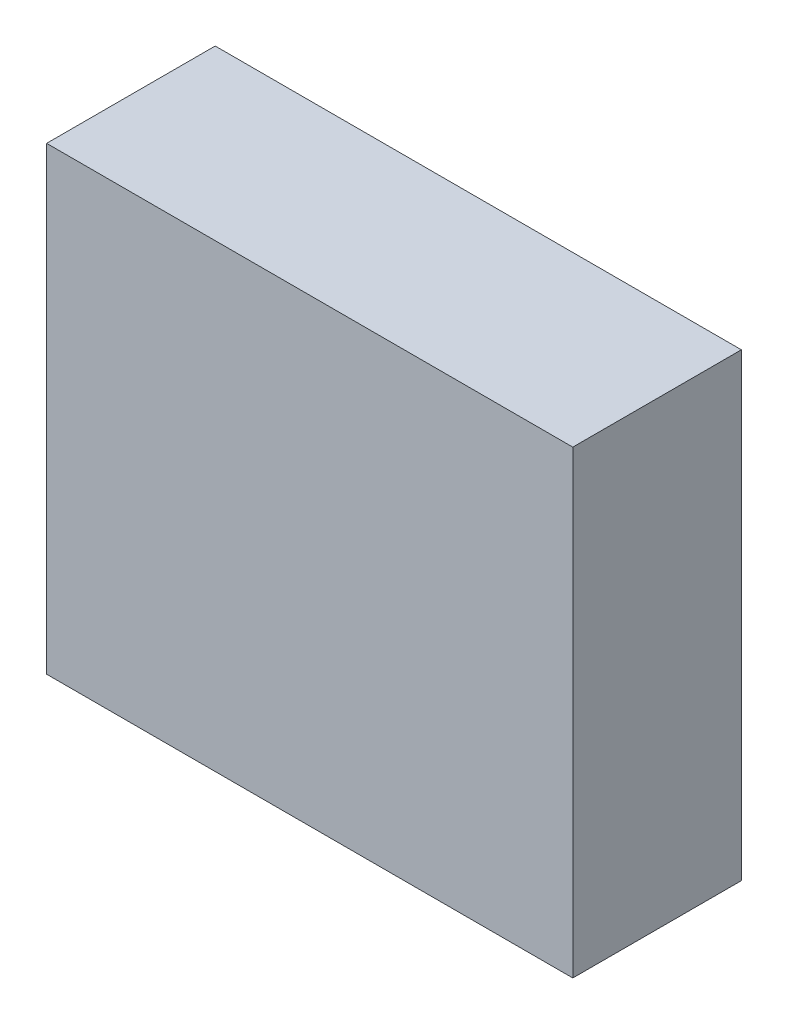
ISO-10303-21;
HEADER;
FILE_DESCRIPTION(('STEP AP214'),'2;1');
FILE_NAME('part.step','',(''),(''),'','','');
FILE_SCHEMA(('AUTOMOTIVE_DESIGN { 1 0 10303 214 1 1 1 1 }'));
ENDSEC;
DATA;
#1=APPLICATION_CONTEXT('core data for automotive mechanical design processes');
#2=APPLICATION_PROTOCOL_DEFINITION('international standard','automotive_design',2000,#1);
#3=PRODUCT_CONTEXT('',#1,'mechanical');
#4=PRODUCT('Part','Part','',(#3));
#5=PRODUCT_RELATED_PRODUCT_CATEGORY('part','',(#4));
#6=PRODUCT_DEFINITION_FORMATION('','',#4);
#7=PRODUCT_DEFINITION_CONTEXT('part definition',#1,'design');
#8=PRODUCT_DEFINITION('design','',#6,#7);
#9=PRODUCT_DEFINITION_SHAPE('','',#8);
#10=(LENGTH_UNIT() NAMED_UNIT(*) SI_UNIT(.MILLI.,.METRE.));
#11=(NAMED_UNIT(*) PLANE_ANGLE_UNIT() SI_UNIT($,.RADIAN.));
#12=(NAMED_UNIT(*) SI_UNIT($,.STERADIAN.) SOLID_ANGLE_UNIT());
#13=UNCERTAINTY_MEASURE_WITH_UNIT(LENGTH_MEASURE(1.E-05),#10,'distance_accuracy_value','');
#14=(GEOMETRIC_REPRESENTATION_CONTEXT(3) GLOBAL_UNCERTAINTY_ASSIGNED_CONTEXT((#13)) GLOBAL_UNIT_ASSIGNED_CONTEXT((#10,
#11,#12)) REPRESENTATION_CONTEXT('',''));
#15=CARTESIAN_POINT('',(0.,0.,0.));
#16=DIRECTION('',(0.,0.,1.));
#17=DIRECTION('',(1.,0.,0.));
#18=AXIS2_PLACEMENT_3D('',#15,#16,#17);
#19=CARTESIAN_POINT('',(-11.2498269896194,-9.34793211402207,3.3));
#20=DIRECTION('',(0.,1.,0.));
#21=DIRECTION('',(0.,0.,1.));
#22=AXIS2_PLACEMENT_3D('',#19,#20,#21);
#23=PLANE('',#22);
#24=DIRECTION('',(1.,0.,0.));
#25=VECTOR('',#24,1.);
#26=CARTESIAN_POINT('',(-11.2498269896194,-9.34793211402207,0.));
#27=LINE('',#26,#25);
#28=CARTESIAN_POINT('',(-11.2498269896194,-9.34793211402207,0.));
#29=VERTEX_POINT('',#28);
#30=CARTESIAN_POINT('',(-0.949826989619349,-9.34793211402207,0.));
#31=VERTEX_POINT('',#30);
#32=EDGE_CURVE('E114',#29,#31,#27,.T.);
#33=ORIENTED_EDGE('',*,*,#32,.F.);
#34=DIRECTION('',(0.,0.,-1.));
#35=VECTOR('',#34,1.);
#36=CARTESIAN_POINT('',(-11.2498269896194,-9.34793211402207,3.3));
#37=LINE('',#36,#35);
#38=CARTESIAN_POINT('',(-11.2498269896194,-9.34793211402207,3.3));
#39=VERTEX_POINT('',#38);
#40=EDGE_CURVE('E11',#39,#29,#37,.T.);
#41=ORIENTED_EDGE('',*,*,#40,.F.);
#42=DIRECTION('',(1.,0.,0.));
#43=VECTOR('',#42,1.);
#44=CARTESIAN_POINT('',(-11.2498269896194,-9.34793211402207,3.3));
#45=LINE('',#44,#43);
#46=CARTESIAN_POINT('',(-0.949826989619349,-9.34793211402207,3.3));
#47=VERTEX_POINT('',#46);
#48=EDGE_CURVE('E107',#39,#47,#45,.T.);
#49=ORIENTED_EDGE('',*,*,#48,.T.);
#50=DIRECTION('',(0.,0.,-1.));
#51=VECTOR('',#50,1.);
#52=CARTESIAN_POINT('',(-0.949826989619349,-9.34793211402207,3.3));
#53=LINE('',#52,#51);
#54=EDGE_CURVE('E46',#47,#31,#53,.T.);
#55=ORIENTED_EDGE('',*,*,#54,.T.);
#56=EDGE_LOOP('',(#33,#41,#49,#55));
#57=FACE_BOUND('',#56,.T.);
#58=ADVANCED_FACE('F43',(#57),#23,.T.);
#59=CARTESIAN_POINT('',(-11.2498269896194,-9.34793211402207,3.3));
#60=DIRECTION('',(1.,0.,0.));
#61=DIRECTION('',(0.,1.,0.));
#62=AXIS2_PLACEMENT_3D('',#59,#60,#61);
#63=PLANE('',#62);
#64=DIRECTION('',(0.,-1.,0.));
#65=VECTOR('',#64,1.);
#66=CARTESIAN_POINT('',(-11.2498269896194,-9.34793211402207,0.));
#67=LINE('',#66,#65);
#68=CARTESIAN_POINT('',(-11.2498269896193,-18.3479321140221,0.));
#69=VERTEX_POINT('',#68);
#70=EDGE_CURVE('E77',#29,#69,#67,.T.);
#71=ORIENTED_EDGE('',*,*,#70,.T.);
#72=DIRECTION('',(0.,0.,-1.));
#73=VECTOR('',#72,1.);
#74=CARTESIAN_POINT('',(-11.2498269896193,-18.3479321140221,3.3));
#75=LINE('',#74,#73);
#76=CARTESIAN_POINT('',(-11.2498269896193,-18.3479321140221,3.3));
#77=VERTEX_POINT('',#76);
#78=EDGE_CURVE('E53',#77,#69,#75,.T.);
#79=ORIENTED_EDGE('',*,*,#78,.F.);
#80=DIRECTION('',(0.,-1.,0.));
#81=VECTOR('',#80,1.);
#82=CARTESIAN_POINT('',(-11.2498269896194,-9.34793211402207,3.3));
#83=LINE('',#82,#81);
#84=EDGE_CURVE('E94',#39,#77,#83,.T.);
#85=ORIENTED_EDGE('',*,*,#84,.F.);
#86=ORIENTED_EDGE('',*,*,#40,.T.);
#87=EDGE_LOOP('',(#71,#79,#85,#86));
#88=FACE_BOUND('',#87,.T.);
#89=ADVANCED_FACE('F130',(#88),#63,.F.);
#90=CARTESIAN_POINT('',(-11.2498269896193,-18.3479321140221,3.3));
#91=DIRECTION('',(0.,1.,0.));
#92=DIRECTION('',(0.,0.,1.));
#93=AXIS2_PLACEMENT_3D('',#90,#91,#92);
#94=PLANE('',#93);
#95=DIRECTION('',(1.,0.,0.));
#96=VECTOR('',#95,1.);
#97=CARTESIAN_POINT('',(-11.2498269896193,-18.3479321140221,0.));
#98=LINE('',#97,#96);
#99=CARTESIAN_POINT('',(-0.949826989619346,-18.3479321140221,0.));
#100=VERTEX_POINT('',#99);
#101=EDGE_CURVE('E102',#69,#100,#98,.T.);
#102=ORIENTED_EDGE('',*,*,#101,.T.);
#103=DIRECTION('',(0.,0.,-1.));
#104=VECTOR('',#103,1.);
#105=CARTESIAN_POINT('',(-0.949826989619346,-18.3479321140221,3.3));
#106=LINE('',#105,#104);
#107=CARTESIAN_POINT('',(-0.949826989619346,-18.3479321140221,3.3));
#108=VERTEX_POINT('',#107);
#109=EDGE_CURVE('E99',#108,#100,#106,.T.);
#110=ORIENTED_EDGE('',*,*,#109,.F.);
#111=DIRECTION('',(1.,0.,0.));
#112=VECTOR('',#111,1.);
#113=CARTESIAN_POINT('',(-11.2498269896193,-18.3479321140221,3.3));
#114=LINE('',#113,#112);
#115=EDGE_CURVE('E89',#77,#108,#114,.T.);
#116=ORIENTED_EDGE('',*,*,#115,.F.);
#117=ORIENTED_EDGE('',*,*,#78,.T.);
#118=EDGE_LOOP('',(#102,#110,#116,#117));
#119=FACE_BOUND('',#118,.T.);
#120=ADVANCED_FACE('F100',(#119),#94,.F.);
#121=CARTESIAN_POINT('',(-0.949826989619349,-9.34793211402207,3.3));
#122=DIRECTION('',(1.,0.,0.));
#123=DIRECTION('',(0.,1.,0.));
#124=AXIS2_PLACEMENT_3D('',#121,#122,#123);
#125=PLANE('',#124);
#126=DIRECTION('',(0.,-1.,0.));
#127=VECTOR('',#126,1.);
#128=CARTESIAN_POINT('',(-0.949826989619349,-9.34793211402207,0.));
#129=LINE('',#128,#127);
#130=EDGE_CURVE('E118',#31,#100,#129,.T.);
#131=ORIENTED_EDGE('',*,*,#130,.F.);
#132=ORIENTED_EDGE('',*,*,#54,.F.);
#133=DIRECTION('',(0.,-1.,0.));
#134=VECTOR('',#133,1.);
#135=CARTESIAN_POINT('',(-0.949826989619349,-9.34793211402207,3.3));
#136=LINE('',#135,#134);
#137=EDGE_CURVE('E93',#47,#108,#136,.T.);
#138=ORIENTED_EDGE('',*,*,#137,.T.);
#139=ORIENTED_EDGE('',*,*,#109,.T.);
#140=EDGE_LOOP('',(#131,#132,#138,#139));
#141=FACE_BOUND('',#140,.T.);
#142=ADVANCED_FACE('F105',(#141),#125,.T.);
#143=CARTESIAN_POINT('',(0.,0.,3.3));
#144=DIRECTION('',(0.,0.,-1.));
#145=DIRECTION('',(-1.,0.,0.));
#146=AXIS2_PLACEMENT_3D('',#143,#144,#145);
#147=PLANE('',#146);
#148=ORIENTED_EDGE('',*,*,#48,.F.);
#149=ORIENTED_EDGE('',*,*,#84,.T.);
#150=ORIENTED_EDGE('',*,*,#115,.T.);
#151=ORIENTED_EDGE('',*,*,#137,.F.);
#152=EDGE_LOOP('',(#148,#149,#150,#151));
#153=FACE_BOUND('',#152,.T.);
#154=ADVANCED_FACE('F92',(#153),#147,.F.);
#155=CARTESIAN_POINT('',(0.,0.,0.));
#156=DIRECTION('',(0.,0.,-1.));
#157=DIRECTION('',(-1.,0.,0.));
#158=AXIS2_PLACEMENT_3D('',#155,#156,#157);
#159=PLANE('',#158);
#160=ORIENTED_EDGE('',*,*,#32,.T.);
#161=ORIENTED_EDGE('',*,*,#130,.T.);
#162=ORIENTED_EDGE('',*,*,#101,.F.);
#163=ORIENTED_EDGE('',*,*,#70,.F.);
#164=EDGE_LOOP('',(#160,#161,#162,#163));
#165=FACE_BOUND('',#164,.T.);
#166=ADVANCED_FACE('F127',(#165),#159,.T.);
#167=CLOSED_SHELL('',(#58,#89,#120,#142,#154,#166));
#168=MANIFOLD_SOLID_BREP('B2',#167);
#169=ADVANCED_BREP_SHAPE_REPRESENTATION('',(#18,#168),#14);
#170=SHAPE_DEFINITION_REPRESENTATION(#9,#169);
ENDSEC;
END-ISO-10303-21;
